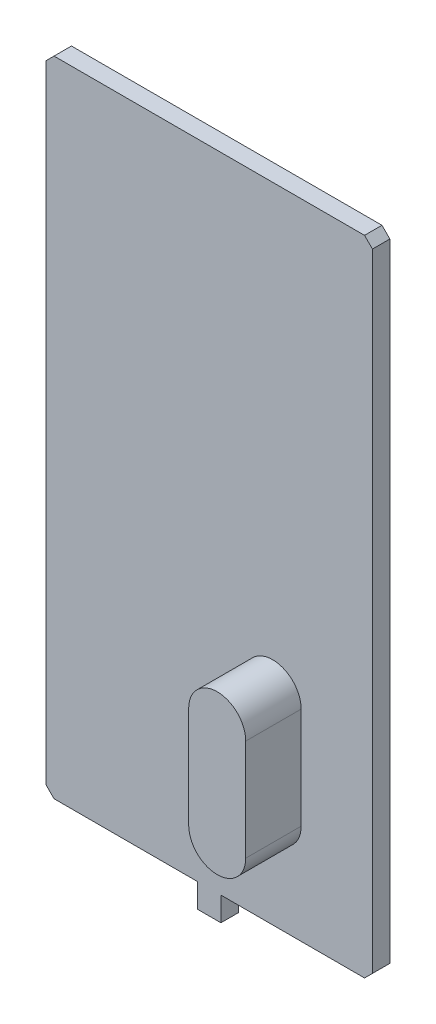
ISO-10303-21;
HEADER;
FILE_DESCRIPTION(('STEP AP214'),'2;1');
FILE_NAME('part.step','',(''),(''),'','','');
FILE_SCHEMA(('AUTOMOTIVE_DESIGN { 1 0 10303 214 1 1 1 1 }'));
ENDSEC;
DATA;
#1=APPLICATION_CONTEXT('core data for automotive mechanical design processes');
#2=APPLICATION_PROTOCOL_DEFINITION('international standard','automotive_design',2000,#1);
#3=PRODUCT_CONTEXT('',#1,'mechanical');
#4=PRODUCT('Part','Part','',(#3));
#5=PRODUCT_RELATED_PRODUCT_CATEGORY('part','',(#4));
#6=PRODUCT_DEFINITION_FORMATION('','',#4);
#7=PRODUCT_DEFINITION_CONTEXT('part definition',#1,'design');
#8=PRODUCT_DEFINITION('design','',#6,#7);
#9=PRODUCT_DEFINITION_SHAPE('','',#8);
#10=(LENGTH_UNIT() NAMED_UNIT(*) SI_UNIT(.MILLI.,.METRE.));
#11=(NAMED_UNIT(*) PLANE_ANGLE_UNIT() SI_UNIT($,.RADIAN.));
#12=(NAMED_UNIT(*) SI_UNIT($,.STERADIAN.) SOLID_ANGLE_UNIT());
#13=UNCERTAINTY_MEASURE_WITH_UNIT(LENGTH_MEASURE(1.E-05),#10,'distance_accuracy_value','');
#14=(GEOMETRIC_REPRESENTATION_CONTEXT(3) GLOBAL_UNCERTAINTY_ASSIGNED_CONTEXT((#13)) GLOBAL_UNIT_ASSIGNED_CONTEXT((#10,
#11,#12)) REPRESENTATION_CONTEXT('',''));
#15=CARTESIAN_POINT('',(0.,0.,0.));
#16=DIRECTION('',(0.,0.,1.));
#17=DIRECTION('',(1.,0.,0.));
#18=AXIS2_PLACEMENT_3D('',#15,#16,#17);
#19=CARTESIAN_POINT('',(-10.3,-20.3,1.1));
#20=DIRECTION('',(0.,1.,0.));
#21=DIRECTION('',(0.,0.,1.));
#22=AXIS2_PLACEMENT_3D('',#19,#20,#21);
#23=PLANE('',#22);
#24=DIRECTION('',(1.,0.,0.));
#25=VECTOR('',#24,1.);
#26=CARTESIAN_POINT('',(-10.3,-20.3,0.));
#27=LINE('',#26,#25);
#28=CARTESIAN_POINT('',(0.734613640369624,-20.3,0.));
#29=VERTEX_POINT('',#28);
#30=CARTESIAN_POINT('',(9.80000000000001,-20.3,0.));
#31=VERTEX_POINT('',#30);
#32=EDGE_CURVE('E235',#29,#31,#27,.T.);
#33=ORIENTED_EDGE('',*,*,#32,.T.);
#34=DIRECTION('',(0.,0.,1.));
#35=VECTOR('',#34,1.);
#36=CARTESIAN_POINT('',(9.80000000000001,-20.3,1.1));
#37=LINE('',#36,#35);
#38=CARTESIAN_POINT('',(9.8,-20.3,1.1));
#39=VERTEX_POINT('',#38);
#40=EDGE_CURVE('E264',#31,#39,#37,.T.);
#41=ORIENTED_EDGE('',*,*,#40,.T.);
#42=DIRECTION('',(1.,0.,0.));
#43=VECTOR('',#42,1.);
#44=CARTESIAN_POINT('',(-10.3,-20.3,1.1));
#45=LINE('',#44,#43);
#46=CARTESIAN_POINT('',(0.73461364036962,-20.3,1.1));
#47=VERTEX_POINT('',#46);
#48=EDGE_CURVE('E225',#47,#39,#45,.T.);
#49=ORIENTED_EDGE('',*,*,#48,.F.);
#50=DIRECTION('',(0.,0.,-1.));
#51=VECTOR('',#50,1.);
#52=CARTESIAN_POINT('',(0.734613640369624,-20.3,1.1));
#53=LINE('',#52,#51);
#54=EDGE_CURVE('E184',#47,#29,#53,.T.);
#55=ORIENTED_EDGE('',*,*,#54,.T.);
#56=EDGE_LOOP('',(#33,#41,#49,#55));
#57=FACE_BOUND('',#56,.T.);
#58=ADVANCED_FACE('F37',(#57),#23,.F.);
#59=CARTESIAN_POINT('',(0.,0.,1.1));
#60=DIRECTION('',(0.,0.,1.));
#61=DIRECTION('',(1.,0.,0.));
#62=AXIS2_PLACEMENT_3D('',#59,#60,#61);
#63=PLANE('',#62);
#64=DIRECTION('',(0.,-1.,0.));
#65=VECTOR('',#64,1.);
#66=CARTESIAN_POINT('',(-10.3,20.3,1.1));
#67=LINE('',#66,#65);
#68=CARTESIAN_POINT('',(-10.3,19.8,1.1));
#69=VERTEX_POINT('',#68);
#70=CARTESIAN_POINT('',(-10.3,-19.8,1.1));
#71=VERTEX_POINT('',#70);
#72=EDGE_CURVE('E223',#69,#71,#67,.T.);
#73=ORIENTED_EDGE('',*,*,#72,.T.);
#74=DIRECTION('',(-0.707106781186548,0.707106781186548,0.));
#75=VECTOR('',#74,1.);
#76=CARTESIAN_POINT('',(-15.05,-15.05,1.1));
#77=LINE('',#76,#75);
#78=CARTESIAN_POINT('',(-9.79999999999999,-20.3,1.1));
#79=VERTEX_POINT('',#78);
#80=EDGE_CURVE('E257',#71,#79,#77,.F.);
#81=ORIENTED_EDGE('',*,*,#80,.T.);
#82=CARTESIAN_POINT('',(-0.734613640369634,-20.3,1.1));
#83=VERTEX_POINT('',#82);
#84=EDGE_CURVE('E159',#79,#83,#45,.T.);
#85=ORIENTED_EDGE('',*,*,#84,.T.);
#86=DIRECTION('',(0.,-1.,0.));
#87=VECTOR('',#86,1.);
#88=CARTESIAN_POINT('',(-0.734613640369631,-18.7848694851401,1.1));
#89=LINE('',#88,#87);
#90=CARTESIAN_POINT('',(-0.734613640369631,-21.8151305148599,1.1));
#91=VERTEX_POINT('',#90);
#92=EDGE_CURVE('E150',#83,#91,#89,.T.);
#93=ORIENTED_EDGE('',*,*,#92,.T.);
#94=DIRECTION('',(1.,0.,0.));
#95=VECTOR('',#94,1.);
#96=CARTESIAN_POINT('',(-0.734613640369631,-21.8151305148599,1.1));
#97=LINE('',#96,#95);
#98=CARTESIAN_POINT('',(0.734613640369624,-21.8151305148599,1.1));
#99=VERTEX_POINT('',#98);
#100=EDGE_CURVE('E157',#91,#99,#97,.T.);
#101=ORIENTED_EDGE('',*,*,#100,.T.);
#102=DIRECTION('',(0.,1.,0.));
#103=VECTOR('',#102,1.);
#104=CARTESIAN_POINT('',(0.734613640369624,-18.7848694851401,1.1));
#105=LINE('',#104,#103);
#106=EDGE_CURVE('E163',#99,#47,#105,.T.);
#107=ORIENTED_EDGE('',*,*,#106,.T.);
#108=ORIENTED_EDGE('',*,*,#48,.T.);
#109=DIRECTION('',(-0.707106781186548,-0.707106781186548,0.));
#110=VECTOR('',#109,1.);
#111=CARTESIAN_POINT('',(15.05,-15.05,1.1));
#112=LINE('',#111,#110);
#113=CARTESIAN_POINT('',(10.3,-19.8,1.1));
#114=VERTEX_POINT('',#113);
#115=EDGE_CURVE('E255',#39,#114,#112,.F.);
#116=ORIENTED_EDGE('',*,*,#115,.T.);
#117=DIRECTION('',(0.,1.,0.));
#118=VECTOR('',#117,1.);
#119=CARTESIAN_POINT('',(10.3,20.3,1.1));
#120=LINE('',#119,#118);
#121=CARTESIAN_POINT('',(10.3,19.8,1.1));
#122=VERTEX_POINT('',#121);
#123=EDGE_CURVE('E218',#114,#122,#120,.T.);
#124=ORIENTED_EDGE('',*,*,#123,.T.);
#125=DIRECTION('',(0.707106781186541,-0.707106781186554,0.));
#126=VECTOR('',#125,1.);
#127=CARTESIAN_POINT('',(15.0500000000001,15.0499999999998,1.1));
#128=LINE('',#127,#126);
#129=CARTESIAN_POINT('',(9.79999999999999,20.3,1.1));
#130=VERTEX_POINT('',#129);
#131=EDGE_CURVE('E58',#122,#130,#128,.F.);
#132=ORIENTED_EDGE('',*,*,#131,.T.);
#133=DIRECTION('',(-1.,0.,0.));
#134=VECTOR('',#133,1.);
#135=CARTESIAN_POINT('',(-10.3,20.3,1.1));
#136=LINE('',#135,#134);
#137=CARTESIAN_POINT('',(-9.80000000000001,20.3,1.1));
#138=VERTEX_POINT('',#137);
#139=EDGE_CURVE('E220',#130,#138,#136,.T.);
#140=ORIENTED_EDGE('',*,*,#139,.T.);
#141=DIRECTION('',(0.707106781186548,0.707106781186548,0.));
#142=VECTOR('',#141,1.);
#143=CARTESIAN_POINT('',(-15.05,15.05,1.1));
#144=LINE('',#143,#142);
#145=EDGE_CURVE('E252',#138,#69,#144,.F.);
#146=ORIENTED_EDGE('',*,*,#145,.T.);
#147=EDGE_LOOP('',(#73,#81,#85,#93,#101,#107,#108,#116,#124,#132,#140,#146));
#148=FACE_BOUND('',#147,.T.);
#149=DIRECTION('',(0.,-1.,0.));
#150=VECTOR('',#149,1.);
#151=CARTESIAN_POINT('',(2.20000000000001,-7.6,1.1));
#152=LINE('',#151,#150);
#153=CARTESIAN_POINT('',(2.20000000000001,-7.6,1.1));
#154=VERTEX_POINT('',#153);
#155=CARTESIAN_POINT('',(2.20000000000001,-14.,1.1));
#156=VERTEX_POINT('',#155);
#157=EDGE_CURVE('E202',#154,#156,#152,.T.);
#158=ORIENTED_EDGE('',*,*,#157,.F.);
#159=CARTESIAN_POINT('',(4.,-7.6,1.1));
#160=DIRECTION('',(0.,0.,1.));
#161=DIRECTION('',(1.,0.,0.));
#162=AXIS2_PLACEMENT_3D('',#159,#160,#161);
#163=CIRCLE('',#162,1.8);
#164=CARTESIAN_POINT('',(5.8,-7.6,1.1));
#165=VERTEX_POINT('',#164);
#166=EDGE_CURVE('E188',#165,#154,#163,.T.);
#167=ORIENTED_EDGE('',*,*,#166,.F.);
#168=DIRECTION('',(0.,1.,0.));
#169=VECTOR('',#168,1.);
#170=CARTESIAN_POINT('',(5.8,-7.6,1.1));
#171=LINE('',#170,#169);
#172=CARTESIAN_POINT('',(5.8,-14.,1.1));
#173=VERTEX_POINT('',#172);
#174=EDGE_CURVE('E193',#173,#165,#171,.T.);
#175=ORIENTED_EDGE('',*,*,#174,.F.);
#176=CARTESIAN_POINT('',(4.00000000000001,-14.,1.1));
#177=DIRECTION('',(0.,0.,1.));
#178=DIRECTION('',(1.,0.,0.));
#179=AXIS2_PLACEMENT_3D('',#176,#177,#178);
#180=CIRCLE('',#179,1.8);
#181=EDGE_CURVE('E204',#156,#173,#180,.T.);
#182=ORIENTED_EDGE('',*,*,#181,.F.);
#183=EDGE_LOOP('',(#158,#167,#175,#182));
#184=FACE_BOUND('',#183,.T.);
#185=ADVANCED_FACE('F153',(#148,#184),#63,.T.);
#186=CARTESIAN_POINT('',(10.3,20.3,1.1));
#187=DIRECTION('',(-1.,0.,0.));
#188=DIRECTION('',(0.,-1.,0.));
#189=AXIS2_PLACEMENT_3D('',#186,#187,#188);
#190=PLANE('',#189);
#191=ORIENTED_EDGE('',*,*,#123,.F.);
#192=DIRECTION('',(0.,0.,-1.));
#193=VECTOR('',#192,1.);
#194=CARTESIAN_POINT('',(10.3,-19.8,1.1));
#195=LINE('',#194,#193);
#196=CARTESIAN_POINT('',(10.3,-19.8,0.));
#197=VERTEX_POINT('',#196);
#198=EDGE_CURVE('E261',#114,#197,#195,.T.);
#199=ORIENTED_EDGE('',*,*,#198,.T.);
#200=DIRECTION('',(0.,1.,0.));
#201=VECTOR('',#200,1.);
#202=CARTESIAN_POINT('',(10.3,20.3,0.));
#203=LINE('',#202,#201);
#204=CARTESIAN_POINT('',(10.3,19.8,0.));
#205=VERTEX_POINT('',#204);
#206=EDGE_CURVE('E217',#197,#205,#203,.T.);
#207=ORIENTED_EDGE('',*,*,#206,.T.);
#208=DIRECTION('',(0.,0.,1.));
#209=VECTOR('',#208,1.);
#210=CARTESIAN_POINT('',(10.3,19.8,1.1));
#211=LINE('',#210,#209);
#212=EDGE_CURVE('E259',#205,#122,#211,.T.);
#213=ORIENTED_EDGE('',*,*,#212,.T.);
#214=EDGE_LOOP('',(#191,#199,#207,#213));
#215=FACE_BOUND('',#214,.T.);
#216=ADVANCED_FACE('F277',(#215),#190,.F.);
#217=CARTESIAN_POINT('',(-10.3,20.3,1.1));
#218=DIRECTION('',(0.,-1.,0.));
#219=DIRECTION('',(0.,0.,-1.));
#220=AXIS2_PLACEMENT_3D('',#217,#218,#219);
#221=PLANE('',#220);
#222=ORIENTED_EDGE('',*,*,#139,.F.);
#223=DIRECTION('',(0.,0.,-1.));
#224=VECTOR('',#223,1.);
#225=CARTESIAN_POINT('',(9.79999999999999,20.3,1.1));
#226=LINE('',#225,#224);
#227=CARTESIAN_POINT('',(9.79999999999998,20.3,0.));
#228=VERTEX_POINT('',#227);
#229=EDGE_CURVE('E11',#130,#228,#226,.T.);
#230=ORIENTED_EDGE('',*,*,#229,.T.);
#231=DIRECTION('',(-1.,0.,0.));
#232=VECTOR('',#231,1.);
#233=CARTESIAN_POINT('',(-10.3,20.3,0.));
#234=LINE('',#233,#232);
#235=CARTESIAN_POINT('',(-9.80000000000002,20.3,0.));
#236=VERTEX_POINT('',#235);
#237=EDGE_CURVE('E230',#228,#236,#234,.T.);
#238=ORIENTED_EDGE('',*,*,#237,.T.);
#239=DIRECTION('',(0.,0.,1.));
#240=VECTOR('',#239,1.);
#241=CARTESIAN_POINT('',(-9.80000000000002,20.3,1.1));
#242=LINE('',#241,#240);
#243=EDGE_CURVE('E45',#236,#138,#242,.T.);
#244=ORIENTED_EDGE('',*,*,#243,.T.);
#245=EDGE_LOOP('',(#222,#230,#238,#244));
#246=FACE_BOUND('',#245,.T.);
#247=ADVANCED_FACE('F286',(#246),#221,.F.);
#248=CARTESIAN_POINT('',(-10.3,20.3,1.1));
#249=DIRECTION('',(1.,0.,0.));
#250=DIRECTION('',(0.,1.,0.));
#251=AXIS2_PLACEMENT_3D('',#248,#249,#250);
#252=PLANE('',#251);
#253=DIRECTION('',(0.,-1.,0.));
#254=VECTOR('',#253,1.);
#255=CARTESIAN_POINT('',(-10.3,20.3,0.));
#256=LINE('',#255,#254);
#257=CARTESIAN_POINT('',(-10.3,19.8,0.));
#258=VERTEX_POINT('',#257);
#259=CARTESIAN_POINT('',(-10.3,-19.8,0.));
#260=VERTEX_POINT('',#259);
#261=EDGE_CURVE('E232',#258,#260,#256,.T.);
#262=ORIENTED_EDGE('',*,*,#261,.T.);
#263=DIRECTION('',(0.,0.,1.));
#264=VECTOR('',#263,1.);
#265=CARTESIAN_POINT('',(-10.3,-19.8,1.1));
#266=LINE('',#265,#264);
#267=EDGE_CURVE('E250',#260,#71,#266,.T.);
#268=ORIENTED_EDGE('',*,*,#267,.T.);
#269=ORIENTED_EDGE('',*,*,#72,.F.);
#270=DIRECTION('',(0.,0.,-1.));
#271=VECTOR('',#270,1.);
#272=CARTESIAN_POINT('',(-10.3,19.8,1.1));
#273=LINE('',#272,#271);
#274=EDGE_CURVE('E247',#69,#258,#273,.T.);
#275=ORIENTED_EDGE('',*,*,#274,.T.);
#276=EDGE_LOOP('',(#262,#268,#269,#275));
#277=FACE_BOUND('',#276,.T.);
#278=ADVANCED_FACE('F293',(#277),#252,.F.);
#279=ORIENTED_EDGE('',*,*,#84,.F.);
#280=DIRECTION('',(0.,0.,-1.));
#281=VECTOR('',#280,1.);
#282=CARTESIAN_POINT('',(-9.79999999999999,-20.3,1.1));
#283=LINE('',#282,#281);
#284=CARTESIAN_POINT('',(-9.79999999999999,-20.3,0.));
#285=VERTEX_POINT('',#284);
#286=EDGE_CURVE('E227',#79,#285,#283,.T.);
#287=ORIENTED_EDGE('',*,*,#286,.T.);
#288=CARTESIAN_POINT('',(-0.734613640369634,-20.3,0.));
#289=VERTEX_POINT('',#288);
#290=EDGE_CURVE('E221',#285,#289,#27,.T.);
#291=ORIENTED_EDGE('',*,*,#290,.T.);
#292=DIRECTION('',(0.,0.,1.));
#293=VECTOR('',#292,1.);
#294=CARTESIAN_POINT('',(-0.734613640369631,-20.3,1.1));
#295=LINE('',#294,#293);
#296=EDGE_CURVE('E182',#289,#83,#295,.T.);
#297=ORIENTED_EDGE('',*,*,#296,.T.);
#298=EDGE_LOOP('',(#279,#287,#291,#297));
#299=FACE_BOUND('',#298,.T.);
#300=ADVANCED_FACE('F300',(#299),#23,.F.);
#301=CARTESIAN_POINT('',(0.,0.,0.));
#302=DIRECTION('',(0.,0.,1.));
#303=DIRECTION('',(1.,0.,0.));
#304=AXIS2_PLACEMENT_3D('',#301,#302,#303);
#305=PLANE('',#304);
#306=ORIENTED_EDGE('',*,*,#290,.F.);
#307=DIRECTION('',(0.707106781186548,-0.707106781186548,0.));
#308=VECTOR('',#307,1.);
#309=CARTESIAN_POINT('',(-9.79999999999999,-20.3,0.));
#310=LINE('',#309,#308);
#311=EDGE_CURVE('E245',#285,#260,#310,.F.);
#312=ORIENTED_EDGE('',*,*,#311,.T.);
#313=ORIENTED_EDGE('',*,*,#261,.F.);
#314=DIRECTION('',(-0.707106781186548,-0.707106781186548,0.));
#315=VECTOR('',#314,1.);
#316=CARTESIAN_POINT('',(-10.3,19.8,0.));
#317=LINE('',#316,#315);
#318=EDGE_CURVE('E239',#258,#236,#317,.F.);
#319=ORIENTED_EDGE('',*,*,#318,.T.);
#320=ORIENTED_EDGE('',*,*,#237,.F.);
#321=DIRECTION('',(-0.707106781186541,0.707106781186554,0.));
#322=VECTOR('',#321,1.);
#323=CARTESIAN_POINT('',(9.79999999999999,20.3,0.));
#324=LINE('',#323,#322);
#325=EDGE_CURVE('E241',#228,#205,#324,.F.);
#326=ORIENTED_EDGE('',*,*,#325,.T.);
#327=ORIENTED_EDGE('',*,*,#206,.F.);
#328=DIRECTION('',(0.707106781186548,0.707106781186548,0.));
#329=VECTOR('',#328,1.);
#330=CARTESIAN_POINT('',(10.3,-19.8,0.));
#331=LINE('',#330,#329);
#332=EDGE_CURVE('E243',#197,#31,#331,.F.);
#333=ORIENTED_EDGE('',*,*,#332,.T.);
#334=ORIENTED_EDGE('',*,*,#32,.F.);
#335=DIRECTION('',(0.,-1.,0.));
#336=VECTOR('',#335,1.);
#337=CARTESIAN_POINT('',(0.734613640369624,-18.7848694851401,0.));
#338=LINE('',#337,#336);
#339=CARTESIAN_POINT('',(0.734613640369624,-21.8151305148599,0.));
#340=VERTEX_POINT('',#339);
#341=EDGE_CURVE('E185',#29,#340,#338,.T.);
#342=ORIENTED_EDGE('',*,*,#341,.T.);
#343=DIRECTION('',(-1.,0.,0.));
#344=VECTOR('',#343,1.);
#345=CARTESIAN_POINT('',(-0.734613640369631,-21.8151305148599,0.));
#346=LINE('',#345,#344);
#347=CARTESIAN_POINT('',(-0.734613640369631,-21.8151305148599,0.));
#348=VERTEX_POINT('',#347);
#349=EDGE_CURVE('E301',#340,#348,#346,.T.);
#350=ORIENTED_EDGE('',*,*,#349,.T.);
#351=DIRECTION('',(0.,1.,0.));
#352=VECTOR('',#351,1.);
#353=CARTESIAN_POINT('',(-0.734613640369631,-18.7848694851401,0.));
#354=LINE('',#353,#352);
#355=EDGE_CURVE('E170',#348,#289,#354,.T.);
#356=ORIENTED_EDGE('',*,*,#355,.T.);
#357=EDGE_LOOP('',(#306,#312,#313,#319,#320,#326,#327,#333,#334,#342,#350,#356));
#358=FACE_BOUND('',#357,.T.);
#359=ADVANCED_FACE('F281',(#358),#305,.F.);
#360=CARTESIAN_POINT('',(4.,-7.6,4.6));
#361=DIRECTION('',(0.,0.,-1.));
#362=DIRECTION('',(-1.,0.,0.));
#363=AXIS2_PLACEMENT_3D('',#360,#361,#362);
#364=CYLINDRICAL_SURFACE('',#363,1.8);
#365=ORIENTED_EDGE('',*,*,#166,.T.);
#366=DIRECTION('',(0.,0.,-1.));
#367=VECTOR('',#366,1.);
#368=CARTESIAN_POINT('',(2.20000000000001,-7.6,4.6));
#369=LINE('',#368,#367);
#370=CARTESIAN_POINT('',(2.20000000000001,-7.6,4.6));
#371=VERTEX_POINT('',#370);
#372=EDGE_CURVE('E215',#371,#154,#369,.T.);
#373=ORIENTED_EDGE('',*,*,#372,.F.);
#374=CARTESIAN_POINT('',(4.,-7.6,4.6));
#375=DIRECTION('',(0.,0.,1.));
#376=DIRECTION('',(1.,0.,0.));
#377=AXIS2_PLACEMENT_3D('',#374,#375,#376);
#378=CIRCLE('',#377,1.8);
#379=CARTESIAN_POINT('',(5.8,-7.6,4.6));
#380=VERTEX_POINT('',#379);
#381=EDGE_CURVE('E189',#380,#371,#378,.T.);
#382=ORIENTED_EDGE('',*,*,#381,.F.);
#383=DIRECTION('',(0.,0.,-1.));
#384=VECTOR('',#383,1.);
#385=CARTESIAN_POINT('',(5.8,-7.6,4.6));
#386=LINE('',#385,#384);
#387=EDGE_CURVE('E199',#380,#165,#386,.T.);
#388=ORIENTED_EDGE('',*,*,#387,.T.);
#389=EDGE_LOOP('',(#365,#373,#382,#388));
#390=FACE_BOUND('',#389,.T.);
#391=ADVANCED_FACE('F333',(#390),#364,.T.);
#392=CARTESIAN_POINT('',(2.20000000000001,-7.6,4.6));
#393=DIRECTION('',(1.,0.,0.));
#394=DIRECTION('',(0.,1.,0.));
#395=AXIS2_PLACEMENT_3D('',#392,#393,#394);
#396=PLANE('',#395);
#397=ORIENTED_EDGE('',*,*,#157,.T.);
#398=DIRECTION('',(0.,0.,-1.));
#399=VECTOR('',#398,1.);
#400=CARTESIAN_POINT('',(2.20000000000001,-14.,4.6));
#401=LINE('',#400,#399);
#402=CARTESIAN_POINT('',(2.20000000000001,-14.,4.6));
#403=VERTEX_POINT('',#402);
#404=EDGE_CURVE('E212',#403,#156,#401,.T.);
#405=ORIENTED_EDGE('',*,*,#404,.F.);
#406=DIRECTION('',(0.,-1.,0.));
#407=VECTOR('',#406,1.);
#408=CARTESIAN_POINT('',(2.20000000000001,-7.6,4.6));
#409=LINE('',#408,#407);
#410=EDGE_CURVE('E192',#371,#403,#409,.T.);
#411=ORIENTED_EDGE('',*,*,#410,.F.);
#412=ORIENTED_EDGE('',*,*,#372,.T.);
#413=EDGE_LOOP('',(#397,#405,#411,#412));
#414=FACE_BOUND('',#413,.T.);
#415=ADVANCED_FACE('F387',(#414),#396,.F.);
#416=CARTESIAN_POINT('',(4.00000000000001,-14.,4.6));
#417=DIRECTION('',(0.,0.,-1.));
#418=DIRECTION('',(-1.,0.,0.));
#419=AXIS2_PLACEMENT_3D('',#416,#417,#418);
#420=CYLINDRICAL_SURFACE('',#419,1.8);
#421=ORIENTED_EDGE('',*,*,#181,.T.);
#422=DIRECTION('',(0.,0.,-1.));
#423=VECTOR('',#422,1.);
#424=CARTESIAN_POINT('',(5.8,-14.,4.6));
#425=LINE('',#424,#423);
#426=CARTESIAN_POINT('',(5.8,-14.,4.6));
#427=VERTEX_POINT('',#426);
#428=EDGE_CURVE('E210',#427,#173,#425,.T.);
#429=ORIENTED_EDGE('',*,*,#428,.F.);
#430=CARTESIAN_POINT('',(4.00000000000001,-14.,4.6));
#431=DIRECTION('',(0.,0.,1.));
#432=DIRECTION('',(1.,0.,0.));
#433=AXIS2_PLACEMENT_3D('',#430,#431,#432);
#434=CIRCLE('',#433,1.8);
#435=EDGE_CURVE('E195',#403,#427,#434,.T.);
#436=ORIENTED_EDGE('',*,*,#435,.F.);
#437=ORIENTED_EDGE('',*,*,#404,.T.);
#438=EDGE_LOOP('',(#421,#429,#436,#437));
#439=FACE_BOUND('',#438,.T.);
#440=ADVANCED_FACE('F397',(#439),#420,.T.);
#441=CARTESIAN_POINT('',(5.8,-7.6,4.6));
#442=DIRECTION('',(-1.,0.,0.));
#443=DIRECTION('',(0.,-1.,0.));
#444=AXIS2_PLACEMENT_3D('',#441,#442,#443);
#445=PLANE('',#444);
#446=ORIENTED_EDGE('',*,*,#174,.T.);
#447=ORIENTED_EDGE('',*,*,#387,.F.);
#448=DIRECTION('',(0.,1.,0.));
#449=VECTOR('',#448,1.);
#450=CARTESIAN_POINT('',(5.8,-7.6,4.6));
#451=LINE('',#450,#449);
#452=EDGE_CURVE('E197',#427,#380,#451,.T.);
#453=ORIENTED_EDGE('',*,*,#452,.F.);
#454=ORIENTED_EDGE('',*,*,#428,.T.);
#455=EDGE_LOOP('',(#446,#447,#453,#454));
#456=FACE_BOUND('',#455,.T.);
#457=ADVANCED_FACE('F316',(#456),#445,.F.);
#458=CARTESIAN_POINT('',(4.,-7.6,4.6));
#459=DIRECTION('',(0.,0.,1.));
#460=DIRECTION('',(1.,0.,0.));
#461=AXIS2_PLACEMENT_3D('',#458,#459,#460);
#462=PLANE('',#461);
#463=ORIENTED_EDGE('',*,*,#381,.T.);
#464=ORIENTED_EDGE('',*,*,#410,.T.);
#465=ORIENTED_EDGE('',*,*,#435,.T.);
#466=ORIENTED_EDGE('',*,*,#452,.T.);
#467=EDGE_LOOP('',(#463,#464,#465,#466));
#468=FACE_BOUND('',#467,.T.);
#469=ADVANCED_FACE('F309',(#468),#462,.T.);
#470=CARTESIAN_POINT('',(0.734613640369624,-18.7848694851401,-3.3676565606824));
#471=DIRECTION('',(1.,0.,0.));
#472=DIRECTION('',(0.,0.,-1.));
#473=AXIS2_PLACEMENT_3D('',#470,#471,#472);
#474=PLANE('',#473);
#475=ORIENTED_EDGE('',*,*,#54,.F.);
#476=ORIENTED_EDGE('',*,*,#106,.F.);
#477=DIRECTION('',(0.,0.,1.));
#478=VECTOR('',#477,1.);
#479=CARTESIAN_POINT('',(0.734613640369624,-21.8151305148599,-3.3676565606824));
#480=LINE('',#479,#478);
#481=EDGE_CURVE('E173',#340,#99,#480,.T.);
#482=ORIENTED_EDGE('',*,*,#481,.F.);
#483=ORIENTED_EDGE('',*,*,#341,.F.);
#484=EDGE_LOOP('',(#475,#476,#482,#483));
#485=FACE_BOUND('',#484,.T.);
#486=ADVANCED_FACE('F307',(#485),#474,.T.);
#487=CARTESIAN_POINT('',(-0.734613640369631,-18.7848694851401,-3.3676565606824));
#488=DIRECTION('',(-1.,0.,0.));
#489=DIRECTION('',(0.,0.,1.));
#490=AXIS2_PLACEMENT_3D('',#487,#488,#489);
#491=PLANE('',#490);
#492=ORIENTED_EDGE('',*,*,#296,.F.);
#493=ORIENTED_EDGE('',*,*,#355,.F.);
#494=DIRECTION('',(0.,0.,1.));
#495=VECTOR('',#494,1.);
#496=CARTESIAN_POINT('',(-0.734613640369631,-21.8151305148599,-3.3676565606824));
#497=LINE('',#496,#495);
#498=EDGE_CURVE('E167',#348,#91,#497,.T.);
#499=ORIENTED_EDGE('',*,*,#498,.T.);
#500=ORIENTED_EDGE('',*,*,#92,.F.);
#501=EDGE_LOOP('',(#492,#493,#499,#500));
#502=FACE_BOUND('',#501,.T.);
#503=ADVANCED_FACE('F168',(#502),#491,.T.);
#504=CARTESIAN_POINT('',(-0.734613640369631,-21.8151305148599,-3.3676565606824));
#505=DIRECTION('',(0.,-1.,0.));
#506=DIRECTION('',(0.,0.,-1.));
#507=AXIS2_PLACEMENT_3D('',#504,#505,#506);
#508=PLANE('',#507);
#509=ORIENTED_EDGE('',*,*,#349,.F.);
#510=ORIENTED_EDGE('',*,*,#481,.T.);
#511=ORIENTED_EDGE('',*,*,#100,.F.);
#512=ORIENTED_EDGE('',*,*,#498,.F.);
#513=EDGE_LOOP('',(#509,#510,#511,#512));
#514=FACE_BOUND('',#513,.T.);
#515=ADVANCED_FACE('F175',(#514),#508,.T.);
#516=CARTESIAN_POINT('',(-9.79999999999999,-20.3,1.1));
#517=DIRECTION('',(0.707106781186547,0.707106781186547,0.));
#518=DIRECTION('',(0.,0.,-1.));
#519=AXIS2_PLACEMENT_3D('',#516,#517,#518);
#520=PLANE('',#519);
#521=ORIENTED_EDGE('',*,*,#80,.F.);
#522=ORIENTED_EDGE('',*,*,#267,.F.);
#523=ORIENTED_EDGE('',*,*,#311,.F.);
#524=ORIENTED_EDGE('',*,*,#286,.F.);
#525=EDGE_LOOP('',(#521,#522,#523,#524));
#526=FACE_BOUND('',#525,.T.);
#527=ADVANCED_FACE('F298',(#526),#520,.F.);
#528=CARTESIAN_POINT('',(10.3,-19.8,1.1));
#529=DIRECTION('',(-0.707106781186548,0.707106781186548,0.));
#530=DIRECTION('',(0.,0.,-1.));
#531=AXIS2_PLACEMENT_3D('',#528,#529,#530);
#532=PLANE('',#531);
#533=ORIENTED_EDGE('',*,*,#115,.F.);
#534=ORIENTED_EDGE('',*,*,#40,.F.);
#535=ORIENTED_EDGE('',*,*,#332,.F.);
#536=ORIENTED_EDGE('',*,*,#198,.F.);
#537=EDGE_LOOP('',(#533,#534,#535,#536));
#538=FACE_BOUND('',#537,.T.);
#539=ADVANCED_FACE('F274',(#538),#532,.F.);
#540=CARTESIAN_POINT('',(9.79999999999999,20.3,1.1));
#541=DIRECTION('',(-0.707106781186554,-0.707106781186541,0.));
#542=DIRECTION('',(0.,0.,-1.));
#543=AXIS2_PLACEMENT_3D('',#540,#541,#542);
#544=PLANE('',#543);
#545=ORIENTED_EDGE('',*,*,#131,.F.);
#546=ORIENTED_EDGE('',*,*,#212,.F.);
#547=ORIENTED_EDGE('',*,*,#325,.F.);
#548=ORIENTED_EDGE('',*,*,#229,.F.);
#549=EDGE_LOOP('',(#545,#546,#547,#548));
#550=FACE_BOUND('',#549,.T.);
#551=ADVANCED_FACE('F285',(#550),#544,.F.);
#552=CARTESIAN_POINT('',(-10.3,19.8,1.1));
#553=DIRECTION('',(0.707106781186548,-0.707106781186548,0.));
#554=DIRECTION('',(0.,0.,-1.));
#555=AXIS2_PLACEMENT_3D('',#552,#553,#554);
#556=PLANE('',#555);
#557=ORIENTED_EDGE('',*,*,#145,.F.);
#558=ORIENTED_EDGE('',*,*,#243,.F.);
#559=ORIENTED_EDGE('',*,*,#318,.F.);
#560=ORIENTED_EDGE('',*,*,#274,.F.);
#561=EDGE_LOOP('',(#557,#558,#559,#560));
#562=FACE_BOUND('',#561,.T.);
#563=ADVANCED_FACE('F39',(#562),#556,.F.);
#564=CLOSED_SHELL('',(#58,#185,#216,#247,#278,#300,#359,#391,#415,#440,#457,#469,#486,#503,#515,
#527,#539,#551,#563));
#565=MANIFOLD_SOLID_BREP('B2',#564);
#566=ADVANCED_BREP_SHAPE_REPRESENTATION('',(#18,#565),#14);
#567=SHAPE_DEFINITION_REPRESENTATION(#9,#566);
ENDSEC;
END-ISO-10303-21;
